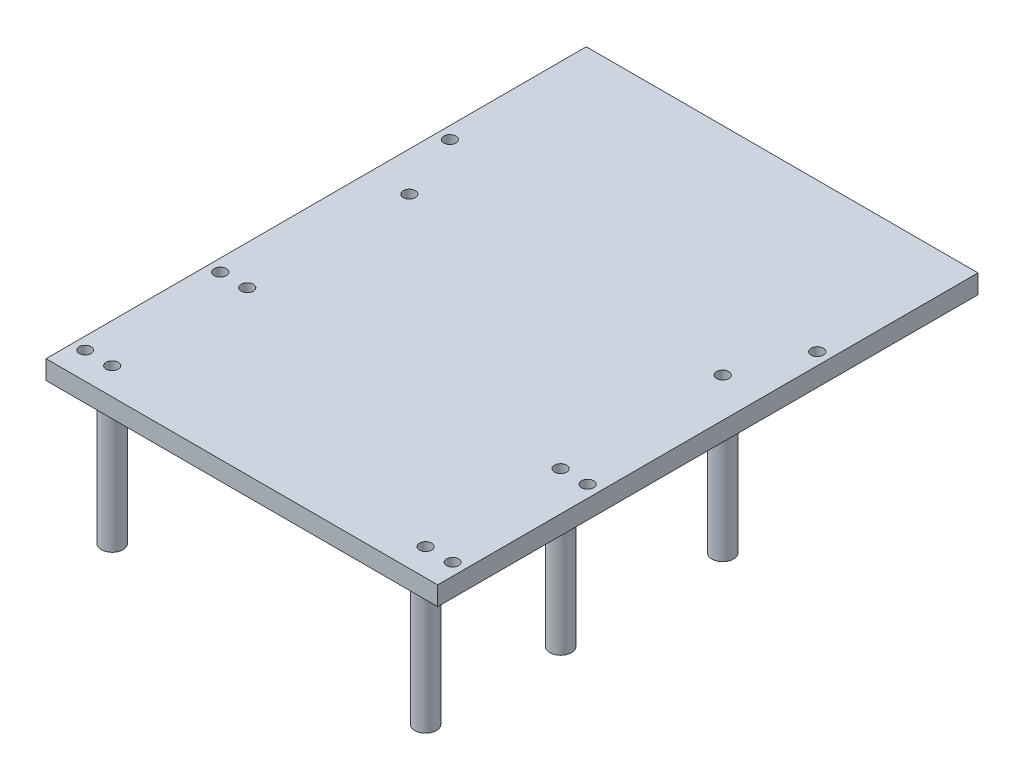
ISO-10303-21;
HEADER;
FILE_DESCRIPTION(('STEP AP214'),'2;1');
FILE_NAME('part.step','',(''),(''),'','','');
FILE_SCHEMA(('AUTOMOTIVE_DESIGN { 1 0 10303 214 1 1 1 1 }'));
ENDSEC;
DATA;
#1=APPLICATION_CONTEXT('core data for automotive mechanical design processes');
#2=APPLICATION_PROTOCOL_DEFINITION('international standard','automotive_design',2000,#1);
#3=PRODUCT_CONTEXT('',#1,'mechanical');
#4=PRODUCT('Part','Part','',(#3));
#5=PRODUCT_RELATED_PRODUCT_CATEGORY('part','',(#4));
#6=PRODUCT_DEFINITION_FORMATION('','',#4);
#7=PRODUCT_DEFINITION_CONTEXT('part definition',#1,'design');
#8=PRODUCT_DEFINITION('design','',#6,#7);
#9=PRODUCT_DEFINITION_SHAPE('','',#8);
#10=(LENGTH_UNIT() NAMED_UNIT(*) SI_UNIT(.MILLI.,.METRE.));
#11=(NAMED_UNIT(*) PLANE_ANGLE_UNIT() SI_UNIT($,.RADIAN.));
#12=(NAMED_UNIT(*) SI_UNIT($,.STERADIAN.) SOLID_ANGLE_UNIT());
#13=UNCERTAINTY_MEASURE_WITH_UNIT(LENGTH_MEASURE(1.E-05),#10,'distance_accuracy_value','');
#14=(GEOMETRIC_REPRESENTATION_CONTEXT(3) GLOBAL_UNCERTAINTY_ASSIGNED_CONTEXT((#13)) GLOBAL_UNIT_ASSIGNED_CONTEXT((#10,
#11,#12)) REPRESENTATION_CONTEXT('',''));
#15=CARTESIAN_POINT('',(0.,0.,0.));
#16=DIRECTION('',(0.,0.,1.));
#17=DIRECTION('',(1.,0.,0.));
#18=AXIS2_PLACEMENT_3D('',#15,#16,#17);
#19=CARTESIAN_POINT('',(-72.5,7.,100.));
#20=DIRECTION('',(1.,0.,0.));
#21=DIRECTION('',(0.,0.,-1.));
#22=AXIS2_PLACEMENT_3D('',#19,#20,#21);
#23=PLANE('',#22);
#24=DIRECTION('',(0.,0.,1.));
#25=VECTOR('',#24,1.);
#26=CARTESIAN_POINT('',(-72.5,0.,100.));
#27=LINE('',#26,#25);
#28=CARTESIAN_POINT('',(-72.5,0.,-100.));
#29=VERTEX_POINT('',#28);
#30=CARTESIAN_POINT('',(-72.5,0.,100.));
#31=VERTEX_POINT('',#30);
#32=EDGE_CURVE('E104',#29,#31,#27,.T.);
#33=ORIENTED_EDGE('',*,*,#32,.T.);
#34=DIRECTION('',(0.,-1.,0.));
#35=VECTOR('',#34,1.);
#36=CARTESIAN_POINT('',(-72.5,7.,100.));
#37=LINE('',#36,#35);
#38=CARTESIAN_POINT('',(-72.5,7.,100.));
#39=VERTEX_POINT('',#38);
#40=EDGE_CURVE('E95',#39,#31,#37,.T.);
#41=ORIENTED_EDGE('',*,*,#40,.F.);
#42=DIRECTION('',(0.,0.,1.));
#43=VECTOR('',#42,1.);
#44=CARTESIAN_POINT('',(-72.5,7.,100.));
#45=LINE('',#44,#43);
#46=CARTESIAN_POINT('',(-72.5,7.,-100.));
#47=VERTEX_POINT('',#46);
#48=EDGE_CURVE('E89',#47,#39,#45,.T.);
#49=ORIENTED_EDGE('',*,*,#48,.F.);
#50=DIRECTION('',(0.,-1.,0.));
#51=VECTOR('',#50,1.);
#52=CARTESIAN_POINT('',(-72.5,7.,-100.));
#53=LINE('',#52,#51);
#54=EDGE_CURVE('E100',#47,#29,#53,.T.);
#55=ORIENTED_EDGE('',*,*,#54,.T.);
#56=EDGE_LOOP('',(#33,#41,#49,#55));
#57=FACE_BOUND('',#56,.T.);
#58=ADVANCED_FACE('F37',(#57),#23,.F.);
#59=CARTESIAN_POINT('',(72.5,7.,100.));
#60=DIRECTION('',(0.,0.,-1.));
#61=DIRECTION('',(-1.,0.,0.));
#62=AXIS2_PLACEMENT_3D('',#59,#60,#61);
#63=PLANE('',#62);
#64=DIRECTION('',(1.,0.,0.));
#65=VECTOR('',#64,1.);
#66=CARTESIAN_POINT('',(72.5,0.,100.));
#67=LINE('',#66,#65);
#68=CARTESIAN_POINT('',(72.5,0.,100.));
#69=VERTEX_POINT('',#68);
#70=EDGE_CURVE('E94',#31,#69,#67,.T.);
#71=ORIENTED_EDGE('',*,*,#70,.T.);
#72=DIRECTION('',(0.,-1.,0.));
#73=VECTOR('',#72,1.);
#74=CARTESIAN_POINT('',(72.5,7.,100.));
#75=LINE('',#74,#73);
#76=CARTESIAN_POINT('',(72.5,7.,100.));
#77=VERTEX_POINT('',#76);
#78=EDGE_CURVE('E92',#77,#69,#75,.T.);
#79=ORIENTED_EDGE('',*,*,#78,.F.);
#80=DIRECTION('',(1.,0.,0.));
#81=VECTOR('',#80,1.);
#82=CARTESIAN_POINT('',(72.5,7.,100.));
#83=LINE('',#82,#81);
#84=EDGE_CURVE('E84',#39,#77,#83,.T.);
#85=ORIENTED_EDGE('',*,*,#84,.F.);
#86=ORIENTED_EDGE('',*,*,#40,.T.);
#87=EDGE_LOOP('',(#71,#79,#85,#86));
#88=FACE_BOUND('',#87,.T.);
#89=ADVANCED_FACE('F93',(#88),#63,.F.);
#90=CARTESIAN_POINT('',(72.5,7.,100.));
#91=DIRECTION('',(-1.,0.,0.));
#92=DIRECTION('',(0.,0.,1.));
#93=AXIS2_PLACEMENT_3D('',#90,#91,#92);
#94=PLANE('',#93);
#95=DIRECTION('',(0.,0.,-1.));
#96=VECTOR('',#95,1.);
#97=CARTESIAN_POINT('',(72.5,0.,100.));
#98=LINE('',#97,#96);
#99=CARTESIAN_POINT('',(72.5,0.,-100.));
#100=VERTEX_POINT('',#99);
#101=EDGE_CURVE('E70',#69,#100,#98,.T.);
#102=ORIENTED_EDGE('',*,*,#101,.T.);
#103=DIRECTION('',(0.,-1.,0.));
#104=VECTOR('',#103,1.);
#105=CARTESIAN_POINT('',(72.5,7.,-100.));
#106=LINE('',#105,#104);
#107=CARTESIAN_POINT('',(72.5,7.,-100.));
#108=VERTEX_POINT('',#107);
#109=EDGE_CURVE('E96',#108,#100,#106,.T.);
#110=ORIENTED_EDGE('',*,*,#109,.F.);
#111=DIRECTION('',(0.,0.,-1.));
#112=VECTOR('',#111,1.);
#113=CARTESIAN_POINT('',(72.5,7.,100.));
#114=LINE('',#113,#112);
#115=EDGE_CURVE('E87',#77,#108,#114,.T.);
#116=ORIENTED_EDGE('',*,*,#115,.F.);
#117=ORIENTED_EDGE('',*,*,#78,.T.);
#118=EDGE_LOOP('',(#102,#110,#116,#117));
#119=FACE_BOUND('',#118,.T.);
#120=ADVANCED_FACE('F98',(#119),#94,.F.);
#121=CARTESIAN_POINT('',(72.5,7.,-100.));
#122=DIRECTION('',(0.,0.,1.));
#123=DIRECTION('',(1.,0.,0.));
#124=AXIS2_PLACEMENT_3D('',#121,#122,#123);
#125=PLANE('',#124);
#126=DIRECTION('',(-1.,0.,0.));
#127=VECTOR('',#126,1.);
#128=CARTESIAN_POINT('',(72.5,0.,-100.));
#129=LINE('',#128,#127);
#130=EDGE_CURVE('E76',#100,#29,#129,.T.);
#131=ORIENTED_EDGE('',*,*,#130,.T.);
#132=ORIENTED_EDGE('',*,*,#54,.F.);
#133=DIRECTION('',(-1.,0.,0.));
#134=VECTOR('',#133,1.);
#135=CARTESIAN_POINT('',(72.5,7.,-100.));
#136=LINE('',#135,#134);
#137=EDGE_CURVE('E53',#108,#47,#136,.T.);
#138=ORIENTED_EDGE('',*,*,#137,.F.);
#139=ORIENTED_EDGE('',*,*,#109,.T.);
#140=EDGE_LOOP('',(#131,#132,#138,#139));
#141=FACE_BOUND('',#140,.T.);
#142=ADVANCED_FACE('F155',(#141),#125,.F.);
#143=CARTESIAN_POINT('',(0.,7.,0.));
#144=DIRECTION('',(0.,1.,0.));
#145=DIRECTION('',(0.,0.,1.));
#146=AXIS2_PLACEMENT_3D('',#143,#144,#145);
#147=PLANE('',#146);
#148=CARTESIAN_POINT('',(58.,7.,90.));
#149=DIRECTION('',(0.,-1.,0.));
#150=DIRECTION('',(0.,0.,1.));
#151=AXIS2_PLACEMENT_3D('',#148,#149,#150);
#152=CIRCLE('',#151,2.25);
#153=CARTESIAN_POINT('',(58.,7.,92.25));
#154=VERTEX_POINT('',#153);
#155=EDGE_CURVE('E464',#154,#154,#152,.T.);
#156=ORIENTED_EDGE('',*,*,#155,.T.);
#157=EDGE_LOOP('',(#156));
#158=FACE_BOUND('',#157,.T.);
#159=CARTESIAN_POINT('',(58.,7.,40.));
#160=DIRECTION('',(0.,-1.,0.));
#161=DIRECTION('',(0.,0.,1.));
#162=AXIS2_PLACEMENT_3D('',#159,#160,#161);
#163=CIRCLE('',#162,2.25);
#164=CARTESIAN_POINT('',(58.,7.,42.25));
#165=VERTEX_POINT('',#164);
#166=EDGE_CURVE('E458',#165,#165,#163,.T.);
#167=ORIENTED_EDGE('',*,*,#166,.T.);
#168=EDGE_LOOP('',(#167));
#169=FACE_BOUND('',#168,.T.);
#170=CARTESIAN_POINT('',(58.,7.,-20.));
#171=DIRECTION('',(0.,-1.,0.));
#172=DIRECTION('',(0.,0.,1.));
#173=AXIS2_PLACEMENT_3D('',#170,#171,#172);
#174=CIRCLE('',#173,2.25);
#175=CARTESIAN_POINT('',(58.,7.,-17.75));
#176=VERTEX_POINT('',#175);
#177=EDGE_CURVE('E452',#176,#176,#174,.T.);
#178=ORIENTED_EDGE('',*,*,#177,.T.);
#179=EDGE_LOOP('',(#178));
#180=FACE_BOUND('',#179,.T.);
#181=CARTESIAN_POINT('',(-58.,7.,-20.));
#182=DIRECTION('',(0.,-1.,0.));
#183=DIRECTION('',(0.,0.,-1.));
#184=AXIS2_PLACEMENT_3D('',#181,#182,#183);
#185=CIRCLE('',#184,2.25);
#186=CARTESIAN_POINT('',(-58.,7.,-22.25));
#187=VERTEX_POINT('',#186);
#188=EDGE_CURVE('E442',#187,#187,#185,.T.);
#189=ORIENTED_EDGE('',*,*,#188,.T.);
#190=EDGE_LOOP('',(#189));
#191=FACE_BOUND('',#190,.T.);
#192=CARTESIAN_POINT('',(-58.,7.,40.));
#193=DIRECTION('',(0.,-1.,0.));
#194=DIRECTION('',(0.,0.,-1.));
#195=AXIS2_PLACEMENT_3D('',#192,#193,#194);
#196=CIRCLE('',#195,2.25);
#197=CARTESIAN_POINT('',(-58.,7.,37.75));
#198=VERTEX_POINT('',#197);
#199=EDGE_CURVE('E438',#198,#198,#196,.T.);
#200=ORIENTED_EDGE('',*,*,#199,.T.);
#201=EDGE_LOOP('',(#200));
#202=FACE_BOUND('',#201,.T.);
#203=CARTESIAN_POINT('',(-58.,7.,90.));
#204=DIRECTION('',(0.,-1.,0.));
#205=DIRECTION('',(0.,0.,-1.));
#206=AXIS2_PLACEMENT_3D('',#203,#204,#205);
#207=CIRCLE('',#206,2.25);
#208=CARTESIAN_POINT('',(-58.,7.,87.75));
#209=VERTEX_POINT('',#208);
#210=EDGE_CURVE('E470',#209,#209,#207,.T.);
#211=ORIENTED_EDGE('',*,*,#210,.T.);
#212=EDGE_LOOP('',(#211));
#213=FACE_BOUND('',#212,.T.);
#214=CARTESIAN_POINT('',(68.,7.,-45.));
#215=DIRECTION('',(0.,1.,0.));
#216=DIRECTION('',(0.,0.,1.));
#217=AXIS2_PLACEMENT_3D('',#214,#215,#216);
#218=CIRCLE('',#217,2.25);
#219=CARTESIAN_POINT('',(68.,7.,-42.75));
#220=VERTEX_POINT('',#219);
#221=EDGE_CURVE('E107',#220,#220,#218,.T.);
#222=ORIENTED_EDGE('',*,*,#221,.F.);
#223=EDGE_LOOP('',(#222));
#224=FACE_BOUND('',#223,.T.);
#225=CARTESIAN_POINT('',(68.,7.,40.));
#226=DIRECTION('',(0.,1.,0.));
#227=DIRECTION('',(0.,0.,1.));
#228=AXIS2_PLACEMENT_3D('',#225,#226,#227);
#229=CIRCLE('',#228,2.25);
#230=CARTESIAN_POINT('',(68.,7.,42.25));
#231=VERTEX_POINT('',#230);
#232=EDGE_CURVE('E520',#231,#231,#229,.T.);
#233=ORIENTED_EDGE('',*,*,#232,.F.);
#234=EDGE_LOOP('',(#233));
#235=FACE_BOUND('',#234,.T.);
#236=CARTESIAN_POINT('',(68.,7.,90.));
#237=DIRECTION('',(0.,1.,0.));
#238=DIRECTION('',(0.,0.,1.));
#239=AXIS2_PLACEMENT_3D('',#236,#237,#238);
#240=CIRCLE('',#239,2.2);
#241=CARTESIAN_POINT('',(68.,7.,92.2));
#242=VERTEX_POINT('',#241);
#243=EDGE_CURVE('E517',#242,#242,#240,.T.);
#244=ORIENTED_EDGE('',*,*,#243,.F.);
#245=EDGE_LOOP('',(#244));
#246=FACE_BOUND('',#245,.T.);
#247=CARTESIAN_POINT('',(-68.,7.,90.));
#248=DIRECTION('',(0.,1.,0.));
#249=DIRECTION('',(0.,0.,1.));
#250=AXIS2_PLACEMENT_3D('',#247,#248,#249);
#251=CIRCLE('',#250,2.2);
#252=CARTESIAN_POINT('',(-68.,7.,92.2));
#253=VERTEX_POINT('',#252);
#254=EDGE_CURVE('E514',#253,#253,#251,.T.);
#255=ORIENTED_EDGE('',*,*,#254,.F.);
#256=EDGE_LOOP('',(#255));
#257=FACE_BOUND('',#256,.T.);
#258=CARTESIAN_POINT('',(-68.,7.,40.));
#259=DIRECTION('',(0.,1.,0.));
#260=DIRECTION('',(0.,0.,1.));
#261=AXIS2_PLACEMENT_3D('',#258,#259,#260);
#262=CIRCLE('',#261,2.25);
#263=CARTESIAN_POINT('',(-68.,7.,42.25));
#264=VERTEX_POINT('',#263);
#265=EDGE_CURVE('E511',#264,#264,#262,.T.);
#266=ORIENTED_EDGE('',*,*,#265,.F.);
#267=EDGE_LOOP('',(#266));
#268=FACE_BOUND('',#267,.T.);
#269=CARTESIAN_POINT('',(-68.,7.,-45.));
#270=DIRECTION('',(0.,1.,0.));
#271=DIRECTION('',(0.,0.,1.));
#272=AXIS2_PLACEMENT_3D('',#269,#270,#271);
#273=CIRCLE('',#272,2.25);
#274=CARTESIAN_POINT('',(-68.,7.,-42.75));
#275=VERTEX_POINT('',#274);
#276=EDGE_CURVE('E508',#275,#275,#273,.T.);
#277=ORIENTED_EDGE('',*,*,#276,.F.);
#278=EDGE_LOOP('',(#277));
#279=FACE_BOUND('',#278,.T.);
#280=ORIENTED_EDGE('',*,*,#48,.T.);
#281=ORIENTED_EDGE('',*,*,#84,.T.);
#282=ORIENTED_EDGE('',*,*,#115,.T.);
#283=ORIENTED_EDGE('',*,*,#137,.T.);
#284=EDGE_LOOP('',(#280,#281,#282,#283));
#285=FACE_BOUND('',#284,.T.);
#286=ADVANCED_FACE('F85',(#158,#169,#180,#191,#202,#213,#224,#235,#246,#257,#268,#279,#285),
#147,.T.);
#287=CARTESIAN_POINT('',(0.,0.,0.));
#288=DIRECTION('',(0.,1.,0.));
#289=DIRECTION('',(0.,0.,1.));
#290=AXIS2_PLACEMENT_3D('',#287,#288,#289);
#291=PLANE('',#290);
#292=CARTESIAN_POINT('',(58.,0.,40.));
#293=DIRECTION('',(0.,1.,0.));
#294=DIRECTION('',(0.,0.,1.));
#295=AXIS2_PLACEMENT_3D('',#292,#293,#294);
#296=CIRCLE('',#295,4.);
#297=CARTESIAN_POINT('',(58.,0.,44.));
#298=VERTEX_POINT('',#297);
#299=EDGE_CURVE('E476',#298,#298,#296,.T.);
#300=ORIENTED_EDGE('',*,*,#299,.T.);
#301=EDGE_LOOP('',(#300));
#302=FACE_BOUND('',#301,.T.);
#303=CARTESIAN_POINT('',(58.,0.,-20.));
#304=DIRECTION('',(0.,1.,0.));
#305=DIRECTION('',(0.,0.,1.));
#306=AXIS2_PLACEMENT_3D('',#303,#304,#305);
#307=CIRCLE('',#306,3.99999999999999);
#308=CARTESIAN_POINT('',(58.,0.,-16.));
#309=VERTEX_POINT('',#308);
#310=EDGE_CURVE('E482',#309,#309,#307,.T.);
#311=ORIENTED_EDGE('',*,*,#310,.T.);
#312=EDGE_LOOP('',(#311));
#313=FACE_BOUND('',#312,.T.);
#314=CARTESIAN_POINT('',(-58.,0.,-20.));
#315=DIRECTION('',(0.,1.,0.));
#316=DIRECTION('',(0.,0.,1.));
#317=AXIS2_PLACEMENT_3D('',#314,#315,#316);
#318=CIRCLE('',#317,4.);
#319=CARTESIAN_POINT('',(-58.,0.,-16.));
#320=VERTEX_POINT('',#319);
#321=EDGE_CURVE('E11',#320,#320,#318,.F.);
#322=ORIENTED_EDGE('',*,*,#321,.F.);
#323=EDGE_LOOP('',(#322));
#324=FACE_BOUND('',#323,.T.);
#325=CARTESIAN_POINT('',(58.,0.,90.));
#326=DIRECTION('',(0.,1.,0.));
#327=DIRECTION('',(0.,0.,1.));
#328=AXIS2_PLACEMENT_3D('',#325,#326,#327);
#329=CIRCLE('',#328,3.99999999999996);
#330=CARTESIAN_POINT('',(58.,0.,94.));
#331=VERTEX_POINT('',#330);
#332=EDGE_CURVE('E491',#331,#331,#329,.T.);
#333=ORIENTED_EDGE('',*,*,#332,.T.);
#334=EDGE_LOOP('',(#333));
#335=FACE_BOUND('',#334,.T.);
#336=CARTESIAN_POINT('',(-58.,0.,90.));
#337=DIRECTION('',(0.,1.,0.));
#338=DIRECTION('',(0.,0.,1.));
#339=AXIS2_PLACEMENT_3D('',#336,#337,#338);
#340=CIRCLE('',#339,4.);
#341=CARTESIAN_POINT('',(-58.,0.,94.));
#342=VERTEX_POINT('',#341);
#343=EDGE_CURVE('E45',#342,#342,#340,.F.);
#344=ORIENTED_EDGE('',*,*,#343,.F.);
#345=EDGE_LOOP('',(#344));
#346=FACE_BOUND('',#345,.T.);
#347=CARTESIAN_POINT('',(-58.,0.,40.));
#348=DIRECTION('',(0.,1.,0.));
#349=DIRECTION('',(0.,0.,1.));
#350=AXIS2_PLACEMENT_3D('',#347,#348,#349);
#351=CIRCLE('',#350,4.);
#352=CARTESIAN_POINT('',(-58.,0.,44.));
#353=VERTEX_POINT('',#352);
#354=EDGE_CURVE('E114',#353,#353,#351,.F.);
#355=ORIENTED_EDGE('',*,*,#354,.F.);
#356=EDGE_LOOP('',(#355));
#357=FACE_BOUND('',#356,.T.);
#358=CARTESIAN_POINT('',(68.,0.,-45.));
#359=DIRECTION('',(0.,1.,0.));
#360=DIRECTION('',(0.,0.,-1.));
#361=AXIS2_PLACEMENT_3D('',#358,#359,#360);
#362=CIRCLE('',#361,2.25);
#363=CARTESIAN_POINT('',(68.,0.,-47.25));
#364=VERTEX_POINT('',#363);
#365=EDGE_CURVE('E132',#364,#364,#362,.T.);
#366=ORIENTED_EDGE('',*,*,#365,.T.);
#367=EDGE_LOOP('',(#366));
#368=FACE_BOUND('',#367,.T.);
#369=CARTESIAN_POINT('',(68.,0.,40.));
#370=DIRECTION('',(0.,1.,0.));
#371=DIRECTION('',(0.,0.,-1.));
#372=AXIS2_PLACEMENT_3D('',#369,#370,#371);
#373=CIRCLE('',#372,2.25);
#374=CARTESIAN_POINT('',(68.,0.,37.75));
#375=VERTEX_POINT('',#374);
#376=EDGE_CURVE('E136',#375,#375,#373,.T.);
#377=ORIENTED_EDGE('',*,*,#376,.T.);
#378=EDGE_LOOP('',(#377));
#379=FACE_BOUND('',#378,.T.);
#380=CARTESIAN_POINT('',(68.,0.,90.));
#381=DIRECTION('',(0.,1.,0.));
#382=DIRECTION('',(0.,0.,-1.));
#383=AXIS2_PLACEMENT_3D('',#380,#381,#382);
#384=CIRCLE('',#383,2.2);
#385=CARTESIAN_POINT('',(68.,0.,87.8));
#386=VERTEX_POINT('',#385);
#387=EDGE_CURVE('E140',#386,#386,#384,.T.);
#388=ORIENTED_EDGE('',*,*,#387,.T.);
#389=EDGE_LOOP('',(#388));
#390=FACE_BOUND('',#389,.T.);
#391=CARTESIAN_POINT('',(-68.,0.,90.));
#392=DIRECTION('',(0.,1.,0.));
#393=DIRECTION('',(0.,0.,1.));
#394=AXIS2_PLACEMENT_3D('',#391,#392,#393);
#395=CIRCLE('',#394,2.2);
#396=CARTESIAN_POINT('',(-68.,0.,92.2));
#397=VERTEX_POINT('',#396);
#398=EDGE_CURVE('E144',#397,#397,#395,.T.);
#399=ORIENTED_EDGE('',*,*,#398,.T.);
#400=EDGE_LOOP('',(#399));
#401=FACE_BOUND('',#400,.T.);
#402=CARTESIAN_POINT('',(-68.,0.,40.));
#403=DIRECTION('',(0.,1.,0.));
#404=DIRECTION('',(0.,0.,1.));
#405=AXIS2_PLACEMENT_3D('',#402,#403,#404);
#406=CIRCLE('',#405,2.25);
#407=CARTESIAN_POINT('',(-68.,0.,42.25));
#408=VERTEX_POINT('',#407);
#409=EDGE_CURVE('E148',#408,#408,#406,.T.);
#410=ORIENTED_EDGE('',*,*,#409,.T.);
#411=EDGE_LOOP('',(#410));
#412=FACE_BOUND('',#411,.T.);
#413=CARTESIAN_POINT('',(-68.,0.,-45.));
#414=DIRECTION('',(0.,1.,0.));
#415=DIRECTION('',(0.,0.,1.));
#416=AXIS2_PLACEMENT_3D('',#413,#414,#415);
#417=CIRCLE('',#416,2.25);
#418=CARTESIAN_POINT('',(-68.,0.,-42.75));
#419=VERTEX_POINT('',#418);
#420=EDGE_CURVE('E152',#419,#419,#417,.T.);
#421=ORIENTED_EDGE('',*,*,#420,.T.);
#422=EDGE_LOOP('',(#421));
#423=FACE_BOUND('',#422,.T.);
#424=ORIENTED_EDGE('',*,*,#32,.F.);
#425=ORIENTED_EDGE('',*,*,#130,.F.);
#426=ORIENTED_EDGE('',*,*,#101,.F.);
#427=ORIENTED_EDGE('',*,*,#70,.F.);
#428=EDGE_LOOP('',(#424,#425,#426,#427));
#429=FACE_BOUND('',#428,.T.);
#430=ADVANCED_FACE('F121',(#302,#313,#324,#335,#346,#357,#368,#379,#390,#401,#412,#423,#429),
#291,.F.);
#431=CARTESIAN_POINT('',(-68.,0.,-45.));
#432=DIRECTION('',(0.,1.,0.));
#433=DIRECTION('',(0.,0.,1.));
#434=AXIS2_PLACEMENT_3D('',#431,#432,#433);
#435=CYLINDRICAL_SURFACE('',#434,2.25);
#436=ORIENTED_EDGE('',*,*,#276,.T.);
#437=EDGE_LOOP('',(#436));
#438=FACE_BOUND('',#437,.T.);
#439=ORIENTED_EDGE('',*,*,#420,.F.);
#440=EDGE_LOOP('',(#439));
#441=FACE_BOUND('',#440,.T.);
#442=ADVANCED_FACE('F124',(#438,#441),#435,.F.);
#443=CARTESIAN_POINT('',(-68.,0.,40.));
#444=DIRECTION('',(0.,1.,0.));
#445=DIRECTION('',(0.,0.,1.));
#446=AXIS2_PLACEMENT_3D('',#443,#444,#445);
#447=CYLINDRICAL_SURFACE('',#446,2.25);
#448=ORIENTED_EDGE('',*,*,#265,.T.);
#449=EDGE_LOOP('',(#448));
#450=FACE_BOUND('',#449,.T.);
#451=ORIENTED_EDGE('',*,*,#409,.F.);
#452=EDGE_LOOP('',(#451));
#453=FACE_BOUND('',#452,.T.);
#454=ADVANCED_FACE('F189',(#450,#453),#447,.F.);
#455=CARTESIAN_POINT('',(-68.,0.,90.));
#456=DIRECTION('',(0.,1.,0.));
#457=DIRECTION('',(0.,0.,1.));
#458=AXIS2_PLACEMENT_3D('',#455,#456,#457);
#459=CYLINDRICAL_SURFACE('',#458,2.2);
#460=ORIENTED_EDGE('',*,*,#254,.T.);
#461=EDGE_LOOP('',(#460));
#462=FACE_BOUND('',#461,.T.);
#463=ORIENTED_EDGE('',*,*,#398,.F.);
#464=EDGE_LOOP('',(#463));
#465=FACE_BOUND('',#464,.T.);
#466=ADVANCED_FACE('F200',(#462,#465),#459,.F.);
#467=CARTESIAN_POINT('',(68.,0.,90.));
#468=DIRECTION('',(0.,1.,0.));
#469=DIRECTION('',(0.,0.,1.));
#470=AXIS2_PLACEMENT_3D('',#467,#468,#469);
#471=CYLINDRICAL_SURFACE('',#470,2.2);
#472=ORIENTED_EDGE('',*,*,#243,.T.);
#473=EDGE_LOOP('',(#472));
#474=FACE_BOUND('',#473,.T.);
#475=ORIENTED_EDGE('',*,*,#387,.F.);
#476=EDGE_LOOP('',(#475));
#477=FACE_BOUND('',#476,.T.);
#478=ADVANCED_FACE('F210',(#474,#477),#471,.F.);
#479=CARTESIAN_POINT('',(68.,0.,40.));
#480=DIRECTION('',(0.,1.,0.));
#481=DIRECTION('',(0.,0.,1.));
#482=AXIS2_PLACEMENT_3D('',#479,#480,#481);
#483=CYLINDRICAL_SURFACE('',#482,2.25);
#484=ORIENTED_EDGE('',*,*,#232,.T.);
#485=EDGE_LOOP('',(#484));
#486=FACE_BOUND('',#485,.T.);
#487=ORIENTED_EDGE('',*,*,#376,.F.);
#488=EDGE_LOOP('',(#487));
#489=FACE_BOUND('',#488,.T.);
#490=ADVANCED_FACE('F220',(#486,#489),#483,.F.);
#491=CARTESIAN_POINT('',(68.,0.,-45.));
#492=DIRECTION('',(0.,1.,0.));
#493=DIRECTION('',(0.,0.,1.));
#494=AXIS2_PLACEMENT_3D('',#491,#492,#493);
#495=CYLINDRICAL_SURFACE('',#494,2.25);
#496=ORIENTED_EDGE('',*,*,#221,.T.);
#497=EDGE_LOOP('',(#496));
#498=FACE_BOUND('',#497,.T.);
#499=ORIENTED_EDGE('',*,*,#365,.F.);
#500=EDGE_LOOP('',(#499));
#501=FACE_BOUND('',#500,.T.);
#502=ADVANCED_FACE('F230',(#498,#501),#495,.F.);
#503=CARTESIAN_POINT('',(-58.,-50.,40.));
#504=DIRECTION('',(0.,1.,0.));
#505=DIRECTION('',(0.,0.,1.));
#506=AXIS2_PLACEMENT_3D('',#503,#504,#505);
#507=CYLINDRICAL_SURFACE('',#506,4.);
#508=CARTESIAN_POINT('',(-58.,-50.,40.));
#509=DIRECTION('',(0.,-1.,0.));
#510=DIRECTION('',(0.,0.,-1.));
#511=AXIS2_PLACEMENT_3D('',#508,#509,#510);
#512=CIRCLE('',#511,4.);
#513=CARTESIAN_POINT('',(-58.,-50.,36.));
#514=VERTEX_POINT('',#513);
#515=EDGE_CURVE('E499',#514,#514,#512,.T.);
#516=ORIENTED_EDGE('',*,*,#515,.F.);
#517=EDGE_LOOP('',(#516));
#518=FACE_BOUND('',#517,.T.);
#519=ORIENTED_EDGE('',*,*,#354,.T.);
#520=EDGE_LOOP('',(#519));
#521=FACE_BOUND('',#520,.T.);
#522=ADVANCED_FACE('F240',(#518,#521),#507,.T.);
#523=CARTESIAN_POINT('',(0.,-50.,0.));
#524=DIRECTION('',(0.,-1.,0.));
#525=DIRECTION('',(0.,0.,-1.));
#526=AXIS2_PLACEMENT_3D('',#523,#524,#525);
#527=PLANE('',#526);
#528=CARTESIAN_POINT('',(-58.,-50.,40.));
#529=DIRECTION('',(0.,-1.,0.));
#530=DIRECTION('',(0.,0.,-1.));
#531=AXIS2_PLACEMENT_3D('',#528,#529,#530);
#532=CIRCLE('',#531,2.25);
#533=CARTESIAN_POINT('',(-58.,-50.,37.75));
#534=VERTEX_POINT('',#533);
#535=EDGE_CURVE('E441',#534,#534,#532,.T.);
#536=ORIENTED_EDGE('',*,*,#535,.F.);
#537=EDGE_LOOP('',(#536));
#538=FACE_BOUND('',#537,.T.);
#539=ORIENTED_EDGE('',*,*,#515,.T.);
#540=EDGE_LOOP('',(#539));
#541=FACE_BOUND('',#540,.T.);
#542=ADVANCED_FACE('F255',(#538,#541),#527,.T.);
#543=CARTESIAN_POINT('',(-58.,-50.,90.));
#544=DIRECTION('',(0.,1.,0.));
#545=DIRECTION('',(0.,0.,1.));
#546=AXIS2_PLACEMENT_3D('',#543,#544,#545);
#547=CYLINDRICAL_SURFACE('',#546,4.);
#548=CARTESIAN_POINT('',(-58.,-50.,90.));
#549=DIRECTION('',(0.,-1.,0.));
#550=DIRECTION('',(0.,0.,-1.));
#551=AXIS2_PLACEMENT_3D('',#548,#549,#550);
#552=CIRCLE('',#551,4.);
#553=CARTESIAN_POINT('',(-58.,-50.,86.));
#554=VERTEX_POINT('',#553);
#555=EDGE_CURVE('E494',#554,#554,#552,.T.);
#556=ORIENTED_EDGE('',*,*,#555,.F.);
#557=EDGE_LOOP('',(#556));
#558=FACE_BOUND('',#557,.T.);
#559=ORIENTED_EDGE('',*,*,#343,.T.);
#560=EDGE_LOOP('',(#559));
#561=FACE_BOUND('',#560,.T.);
#562=ADVANCED_FACE('F119',(#558,#561),#547,.T.);
#563=CARTESIAN_POINT('',(0.,-50.,0.));
#564=DIRECTION('',(0.,-1.,0.));
#565=DIRECTION('',(0.,0.,-1.));
#566=AXIS2_PLACEMENT_3D('',#563,#564,#565);
#567=PLANE('',#566);
#568=CARTESIAN_POINT('',(-58.,-50.,90.));
#569=DIRECTION('',(0.,-1.,0.));
#570=DIRECTION('',(0.,0.,-1.));
#571=AXIS2_PLACEMENT_3D('',#568,#569,#570);
#572=CIRCLE('',#571,2.25);
#573=CARTESIAN_POINT('',(-58.,-50.,87.75));
#574=VERTEX_POINT('',#573);
#575=EDGE_CURVE('E444',#574,#574,#572,.T.);
#576=ORIENTED_EDGE('',*,*,#575,.F.);
#577=EDGE_LOOP('',(#576));
#578=FACE_BOUND('',#577,.T.);
#579=ORIENTED_EDGE('',*,*,#555,.T.);
#580=EDGE_LOOP('',(#579));
#581=FACE_BOUND('',#580,.T.);
#582=ADVANCED_FACE('F267',(#578,#581),#567,.T.);
#583=CARTESIAN_POINT('',(58.,-50.,90.));
#584=DIRECTION('',(0.,1.,0.));
#585=DIRECTION('',(0.,0.,1.));
#586=AXIS2_PLACEMENT_3D('',#583,#584,#585);
#587=CYLINDRICAL_SURFACE('',#586,3.99999999999996);
#588=CARTESIAN_POINT('',(58.,-50.,90.));
#589=DIRECTION('',(0.,1.,0.));
#590=DIRECTION('',(0.,0.,1.));
#591=AXIS2_PLACEMENT_3D('',#588,#589,#590);
#592=CIRCLE('',#591,3.99999999999996);
#593=CARTESIAN_POINT('',(58.,-50.,94.));
#594=VERTEX_POINT('',#593);
#595=EDGE_CURVE('E490',#594,#594,#592,.T.);
#596=ORIENTED_EDGE('',*,*,#595,.T.);
#597=EDGE_LOOP('',(#596));
#598=FACE_BOUND('',#597,.T.);
#599=ORIENTED_EDGE('',*,*,#332,.F.);
#600=EDGE_LOOP('',(#599));
#601=FACE_BOUND('',#600,.T.);
#602=ADVANCED_FACE('F276',(#598,#601),#587,.T.);
#603=CARTESIAN_POINT('',(58.,-50.,90.));
#604=DIRECTION('',(0.,1.,0.));
#605=DIRECTION('',(0.,0.,1.));
#606=AXIS2_PLACEMENT_3D('',#603,#604,#605);
#607=PLANE('',#606);
#608=CARTESIAN_POINT('',(58.,-50.,90.));
#609=DIRECTION('',(0.,-1.,0.));
#610=DIRECTION('',(0.,0.,1.));
#611=AXIS2_PLACEMENT_3D('',#608,#609,#610);
#612=CIRCLE('',#611,2.25);
#613=CARTESIAN_POINT('',(58.,-50.,92.25));
#614=VERTEX_POINT('',#613);
#615=EDGE_CURVE('E467',#614,#614,#612,.T.);
#616=ORIENTED_EDGE('',*,*,#615,.F.);
#617=EDGE_LOOP('',(#616));
#618=FACE_BOUND('',#617,.T.);
#619=ORIENTED_EDGE('',*,*,#595,.F.);
#620=EDGE_LOOP('',(#619));
#621=FACE_BOUND('',#620,.T.);
#622=ADVANCED_FACE('F281',(#618,#621),#607,.F.);
#623=CARTESIAN_POINT('',(-58.,-50.,-20.));
#624=DIRECTION('',(0.,1.,0.));
#625=DIRECTION('',(0.,0.,1.));
#626=AXIS2_PLACEMENT_3D('',#623,#624,#625);
#627=CYLINDRICAL_SURFACE('',#626,4.);
#628=CARTESIAN_POINT('',(-58.,-50.,-20.));
#629=DIRECTION('',(0.,-1.,0.));
#630=DIRECTION('',(0.,0.,-1.));
#631=AXIS2_PLACEMENT_3D('',#628,#629,#630);
#632=CIRCLE('',#631,4.);
#633=CARTESIAN_POINT('',(-58.,-50.,-24.));
#634=VERTEX_POINT('',#633);
#635=EDGE_CURVE('E485',#634,#634,#632,.T.);
#636=ORIENTED_EDGE('',*,*,#635,.F.);
#637=EDGE_LOOP('',(#636));
#638=FACE_BOUND('',#637,.T.);
#639=ORIENTED_EDGE('',*,*,#321,.T.);
#640=EDGE_LOOP('',(#639));
#641=FACE_BOUND('',#640,.T.);
#642=ADVANCED_FACE('F290',(#638,#641),#627,.T.);
#643=CARTESIAN_POINT('',(-58.,-50.,-20.));
#644=DIRECTION('',(0.,-1.,0.));
#645=DIRECTION('',(0.,0.,-1.));
#646=AXIS2_PLACEMENT_3D('',#643,#644,#645);
#647=PLANE('',#646);
#648=CARTESIAN_POINT('',(-58.,-50.,-20.));
#649=DIRECTION('',(0.,-1.,0.));
#650=DIRECTION('',(0.,0.,-1.));
#651=AXIS2_PLACEMENT_3D('',#648,#649,#650);
#652=CIRCLE('',#651,2.25);
#653=CARTESIAN_POINT('',(-58.,-50.,-22.25));
#654=VERTEX_POINT('',#653);
#655=EDGE_CURVE('E447',#654,#654,#652,.T.);
#656=ORIENTED_EDGE('',*,*,#655,.F.);
#657=EDGE_LOOP('',(#656));
#658=FACE_BOUND('',#657,.T.);
#659=ORIENTED_EDGE('',*,*,#635,.T.);
#660=EDGE_LOOP('',(#659));
#661=FACE_BOUND('',#660,.T.);
#662=ADVANCED_FACE('F295',(#658,#661),#647,.T.);
#663=CARTESIAN_POINT('',(58.,-50.,-20.));
#664=DIRECTION('',(0.,1.,0.));
#665=DIRECTION('',(0.,0.,1.));
#666=AXIS2_PLACEMENT_3D('',#663,#664,#665);
#667=CYLINDRICAL_SURFACE('',#666,3.99999999999999);
#668=CARTESIAN_POINT('',(58.,-50.,-20.));
#669=DIRECTION('',(0.,1.,0.));
#670=DIRECTION('',(0.,0.,1.));
#671=AXIS2_PLACEMENT_3D('',#668,#669,#670);
#672=CIRCLE('',#671,3.99999999999999);
#673=CARTESIAN_POINT('',(58.,-50.,-16.));
#674=VERTEX_POINT('',#673);
#675=EDGE_CURVE('E479',#674,#674,#672,.T.);
#676=ORIENTED_EDGE('',*,*,#675,.T.);
#677=EDGE_LOOP('',(#676));
#678=FACE_BOUND('',#677,.T.);
#679=ORIENTED_EDGE('',*,*,#310,.F.);
#680=EDGE_LOOP('',(#679));
#681=FACE_BOUND('',#680,.T.);
#682=ADVANCED_FACE('F303',(#678,#681),#667,.T.);
#683=CARTESIAN_POINT('',(58.,-50.,-20.));
#684=DIRECTION('',(0.,1.,0.));
#685=DIRECTION('',(0.,0.,1.));
#686=AXIS2_PLACEMENT_3D('',#683,#684,#685);
#687=PLANE('',#686);
#688=CARTESIAN_POINT('',(58.,-50.,-20.));
#689=DIRECTION('',(0.,-1.,0.));
#690=DIRECTION('',(0.,0.,1.));
#691=AXIS2_PLACEMENT_3D('',#688,#689,#690);
#692=CIRCLE('',#691,2.25);
#693=CARTESIAN_POINT('',(58.,-50.,-17.75));
#694=VERTEX_POINT('',#693);
#695=EDGE_CURVE('E455',#694,#694,#692,.T.);
#696=ORIENTED_EDGE('',*,*,#695,.F.);
#697=EDGE_LOOP('',(#696));
#698=FACE_BOUND('',#697,.T.);
#699=ORIENTED_EDGE('',*,*,#675,.F.);
#700=EDGE_LOOP('',(#699));
#701=FACE_BOUND('',#700,.T.);
#702=ADVANCED_FACE('F308',(#698,#701),#687,.F.);
#703=CARTESIAN_POINT('',(58.,-50.,40.));
#704=DIRECTION('',(0.,1.,0.));
#705=DIRECTION('',(0.,0.,1.));
#706=AXIS2_PLACEMENT_3D('',#703,#704,#705);
#707=CYLINDRICAL_SURFACE('',#706,4.);
#708=CARTESIAN_POINT('',(58.,-50.,40.));
#709=DIRECTION('',(0.,1.,0.));
#710=DIRECTION('',(0.,0.,1.));
#711=AXIS2_PLACEMENT_3D('',#708,#709,#710);
#712=CIRCLE('',#711,4.);
#713=CARTESIAN_POINT('',(58.,-50.,44.));
#714=VERTEX_POINT('',#713);
#715=EDGE_CURVE('E473',#714,#714,#712,.T.);
#716=ORIENTED_EDGE('',*,*,#715,.T.);
#717=EDGE_LOOP('',(#716));
#718=FACE_BOUND('',#717,.T.);
#719=ORIENTED_EDGE('',*,*,#299,.F.);
#720=EDGE_LOOP('',(#719));
#721=FACE_BOUND('',#720,.T.);
#722=ADVANCED_FACE('F316',(#718,#721),#707,.T.);
#723=CARTESIAN_POINT('',(58.,-50.,40.));
#724=DIRECTION('',(0.,1.,0.));
#725=DIRECTION('',(0.,0.,1.));
#726=AXIS2_PLACEMENT_3D('',#723,#724,#725);
#727=PLANE('',#726);
#728=CARTESIAN_POINT('',(58.,-50.,40.));
#729=DIRECTION('',(0.,-1.,0.));
#730=DIRECTION('',(0.,0.,1.));
#731=AXIS2_PLACEMENT_3D('',#728,#729,#730);
#732=CIRCLE('',#731,2.25);
#733=CARTESIAN_POINT('',(58.,-50.,42.25));
#734=VERTEX_POINT('',#733);
#735=EDGE_CURVE('E461',#734,#734,#732,.T.);
#736=ORIENTED_EDGE('',*,*,#735,.F.);
#737=EDGE_LOOP('',(#736));
#738=FACE_BOUND('',#737,.T.);
#739=ORIENTED_EDGE('',*,*,#715,.F.);
#740=EDGE_LOOP('',(#739));
#741=FACE_BOUND('',#740,.T.);
#742=ADVANCED_FACE('F321',(#738,#741),#727,.F.);
#743=CARTESIAN_POINT('',(58.,7.,40.));
#744=DIRECTION('',(0.,-1.,0.));
#745=DIRECTION('',(0.,0.,-1.));
#746=AXIS2_PLACEMENT_3D('',#743,#744,#745);
#747=CYLINDRICAL_SURFACE('',#746,2.25);
#748=ORIENTED_EDGE('',*,*,#166,.F.);
#749=EDGE_LOOP('',(#748));
#750=FACE_BOUND('',#749,.T.);
#751=ORIENTED_EDGE('',*,*,#735,.T.);
#752=EDGE_LOOP('',(#751));
#753=FACE_BOUND('',#752,.T.);
#754=ADVANCED_FACE('F371',(#750,#753),#747,.F.);
#755=CARTESIAN_POINT('',(58.,7.,-20.));
#756=DIRECTION('',(0.,-1.,0.));
#757=DIRECTION('',(0.,0.,-1.));
#758=AXIS2_PLACEMENT_3D('',#755,#756,#757);
#759=CYLINDRICAL_SURFACE('',#758,2.25);
#760=ORIENTED_EDGE('',*,*,#177,.F.);
#761=EDGE_LOOP('',(#760));
#762=FACE_BOUND('',#761,.T.);
#763=ORIENTED_EDGE('',*,*,#695,.T.);
#764=EDGE_LOOP('',(#763));
#765=FACE_BOUND('',#764,.T.);
#766=ADVANCED_FACE('F381',(#762,#765),#759,.F.);
#767=CARTESIAN_POINT('',(-58.,7.,-20.));
#768=DIRECTION('',(0.,-1.,0.));
#769=DIRECTION('',(0.,0.,-1.));
#770=AXIS2_PLACEMENT_3D('',#767,#768,#769);
#771=CYLINDRICAL_SURFACE('',#770,2.25);
#772=ORIENTED_EDGE('',*,*,#188,.F.);
#773=EDGE_LOOP('',(#772));
#774=FACE_BOUND('',#773,.T.);
#775=ORIENTED_EDGE('',*,*,#655,.T.);
#776=EDGE_LOOP('',(#775));
#777=FACE_BOUND('',#776,.T.);
#778=ADVANCED_FACE('F391',(#774,#777),#771,.F.);
#779=CARTESIAN_POINT('',(58.,7.,90.));
#780=DIRECTION('',(0.,-1.,0.));
#781=DIRECTION('',(0.,0.,-1.));
#782=AXIS2_PLACEMENT_3D('',#779,#780,#781);
#783=CYLINDRICAL_SURFACE('',#782,2.25);
#784=ORIENTED_EDGE('',*,*,#155,.F.);
#785=EDGE_LOOP('',(#784));
#786=FACE_BOUND('',#785,.T.);
#787=ORIENTED_EDGE('',*,*,#615,.T.);
#788=EDGE_LOOP('',(#787));
#789=FACE_BOUND('',#788,.T.);
#790=ADVANCED_FACE('F401',(#786,#789),#783,.F.);
#791=CARTESIAN_POINT('',(-58.,7.,90.));
#792=DIRECTION('',(0.,-1.,0.));
#793=DIRECTION('',(0.,0.,-1.));
#794=AXIS2_PLACEMENT_3D('',#791,#792,#793);
#795=CYLINDRICAL_SURFACE('',#794,2.25);
#796=ORIENTED_EDGE('',*,*,#210,.F.);
#797=EDGE_LOOP('',(#796));
#798=FACE_BOUND('',#797,.T.);
#799=ORIENTED_EDGE('',*,*,#575,.T.);
#800=EDGE_LOOP('',(#799));
#801=FACE_BOUND('',#800,.T.);
#802=ADVANCED_FACE('F411',(#798,#801),#795,.F.);
#803=CARTESIAN_POINT('',(-58.,7.,40.));
#804=DIRECTION('',(0.,-1.,0.));
#805=DIRECTION('',(0.,0.,-1.));
#806=AXIS2_PLACEMENT_3D('',#803,#804,#805);
#807=CYLINDRICAL_SURFACE('',#806,2.25);
#808=ORIENTED_EDGE('',*,*,#199,.F.);
#809=EDGE_LOOP('',(#808));
#810=FACE_BOUND('',#809,.T.);
#811=ORIENTED_EDGE('',*,*,#535,.T.);
#812=EDGE_LOOP('',(#811));
#813=FACE_BOUND('',#812,.T.);
#814=ADVANCED_FACE('F421',(#810,#813),#807,.F.);
#815=CLOSED_SHELL('',(#58,#89,#120,#142,#286,#430,#442,#454,#466,#478,#490,#502,#522,#542,#562,
#582,#602,#622,#642,#662,#682,#702,#722,#742,#754,#766,#778,#790,#802,#814));
#816=MANIFOLD_SOLID_BREP('B2',#815);
#817=ADVANCED_BREP_SHAPE_REPRESENTATION('',(#18,#816),#14);
#818=SHAPE_DEFINITION_REPRESENTATION(#9,#817);
ENDSEC;
END-ISO-10303-21;
